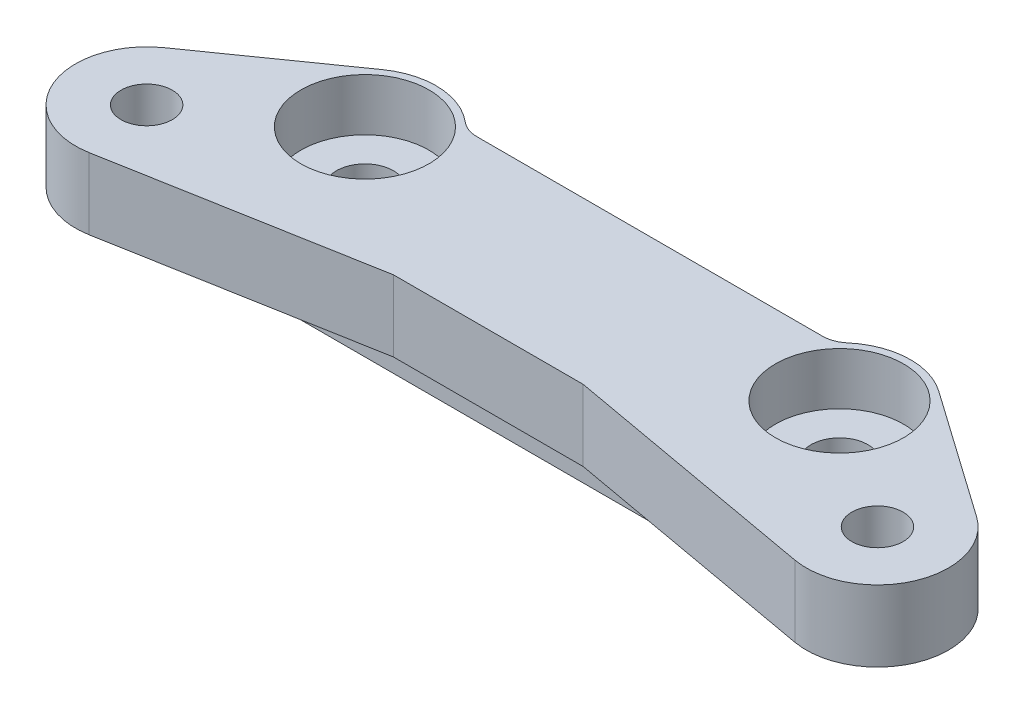
ISO-10303-21;
HEADER;
FILE_DESCRIPTION(('STEP AP214'),'2;1');
FILE_NAME('part.step','',(''),(''),'','','');
FILE_SCHEMA(('AUTOMOTIVE_DESIGN { 1 0 10303 214 1 1 1 1 }'));
ENDSEC;
DATA;
#1=APPLICATION_CONTEXT('core data for automotive mechanical design processes');
#2=APPLICATION_PROTOCOL_DEFINITION('international standard','automotive_design',2000,#1);
#3=PRODUCT_CONTEXT('',#1,'mechanical');
#4=PRODUCT('Part','Part','',(#3));
#5=PRODUCT_RELATED_PRODUCT_CATEGORY('part','',(#4));
#6=PRODUCT_DEFINITION_FORMATION('','',#4);
#7=PRODUCT_DEFINITION_CONTEXT('part definition',#1,'design');
#8=PRODUCT_DEFINITION('design','',#6,#7);
#9=PRODUCT_DEFINITION_SHAPE('','',#8);
#10=(LENGTH_UNIT() NAMED_UNIT(*) SI_UNIT(.MILLI.,.METRE.));
#11=(NAMED_UNIT(*) PLANE_ANGLE_UNIT() SI_UNIT($,.RADIAN.));
#12=(NAMED_UNIT(*) SI_UNIT($,.STERADIAN.) SOLID_ANGLE_UNIT());
#13=UNCERTAINTY_MEASURE_WITH_UNIT(LENGTH_MEASURE(1.E-05),#10,'distance_accuracy_value','');
#14=(GEOMETRIC_REPRESENTATION_CONTEXT(3) GLOBAL_UNCERTAINTY_ASSIGNED_CONTEXT((#13)) GLOBAL_UNIT_ASSIGNED_CONTEXT((#10,
#11,#12)) REPRESENTATION_CONTEXT('',''));
#15=CARTESIAN_POINT('',(0.,0.,0.));
#16=DIRECTION('',(0.,0.,1.));
#17=DIRECTION('',(1.,0.,0.));
#18=AXIS2_PLACEMENT_3D('',#15,#16,#17);
#19=CARTESIAN_POINT('',(0.,27.,-29.));
#20=DIRECTION('',(0.,0.,-1.));
#21=DIRECTION('',(-1.,0.,0.));
#22=AXIS2_PLACEMENT_3D('',#19,#20,#21);
#23=PLANE('',#22);
#24=DIRECTION('',(1.,0.,0.));
#25=VECTOR('',#24,1.);
#26=CARTESIAN_POINT('',(0.,27.,-29.));
#27=LINE('',#26,#25);
#28=CARTESIAN_POINT('',(-36.3985294912646,27.,-29.));
#29=VERTEX_POINT('',#28);
#30=CARTESIAN_POINT('',(36.3985294912645,27.,-29.));
#31=VERTEX_POINT('',#30);
#32=EDGE_CURVE('E203',#29,#31,#27,.T.);
#33=ORIENTED_EDGE('',*,*,#32,.T.);
#34=DIRECTION('',(0.,-1.,0.));
#35=VECTOR('',#34,1.);
#36=CARTESIAN_POINT('',(36.3985294912645,27.,-29.));
#37=LINE('',#36,#35);
#38=CARTESIAN_POINT('',(36.3985294912645,0.,-29.));
#39=VERTEX_POINT('',#38);
#40=EDGE_CURVE('E258',#31,#39,#37,.T.);
#41=ORIENTED_EDGE('',*,*,#40,.T.);
#42=DIRECTION('',(1.,0.,0.));
#43=VECTOR('',#42,1.);
#44=CARTESIAN_POINT('',(0.,0.,-29.));
#45=LINE('',#44,#43);
#46=CARTESIAN_POINT('',(-36.3985294912646,0.,-29.));
#47=VERTEX_POINT('',#46);
#48=EDGE_CURVE('E164',#47,#39,#45,.T.);
#49=ORIENTED_EDGE('',*,*,#48,.F.);
#50=DIRECTION('',(0.,-1.,0.));
#51=VECTOR('',#50,1.);
#52=CARTESIAN_POINT('',(-36.3985294912646,27.,-29.));
#53=LINE('',#52,#51);
#54=EDGE_CURVE('E256',#47,#29,#53,.F.);
#55=ORIENTED_EDGE('',*,*,#54,.T.);
#56=EDGE_LOOP('',(#33,#41,#49,#55));
#57=FACE_BOUND('',#56,.T.);
#58=ADVANCED_FACE('F52',(#57),#23,.T.);
#59=CARTESIAN_POINT('',(-50.,27.,-19.));
#60=DIRECTION('',(0.,-1.,0.));
#61=DIRECTION('',(0.,0.,-1.));
#62=AXIS2_PLACEMENT_3D('',#59,#60,#61);
#63=CYLINDRICAL_SURFACE('',#62,15.);
#64=CARTESIAN_POINT('',(-50.,27.,-19.));
#65=DIRECTION('',(0.,1.,0.));
#66=DIRECTION('',(0.,0.,1.));
#67=AXIS2_PLACEMENT_3D('',#64,#65,#66);
#68=CIRCLE('',#67,15.);
#69=CARTESIAN_POINT('',(-40.2846639223318,27.,-30.4285714285714));
#70=VERTEX_POINT('',#69);
#71=CARTESIAN_POINT('',(-58.6324010926192,27.,-31.2670962895115));
#72=VERTEX_POINT('',#71);
#73=EDGE_CURVE('E206',#70,#72,#68,.T.);
#74=ORIENTED_EDGE('',*,*,#73,.F.);
#75=DIRECTION('',(0.,-1.,0.));
#76=VECTOR('',#75,1.);
#77=CARTESIAN_POINT('',(-40.2846639223318,27.,-30.4285714285714));
#78=LINE('',#77,#76);
#79=CARTESIAN_POINT('',(-40.2846639223318,0.,-30.4285714285714));
#80=VERTEX_POINT('',#79);
#81=EDGE_CURVE('E263',#70,#80,#78,.T.);
#82=ORIENTED_EDGE('',*,*,#81,.T.);
#83=CARTESIAN_POINT('',(-50.,0.,-19.));
#84=DIRECTION('',(0.,1.,0.));
#85=DIRECTION('',(0.,0.,1.));
#86=AXIS2_PLACEMENT_3D('',#83,#84,#85);
#87=CIRCLE('',#86,15.);
#88=CARTESIAN_POINT('',(-50.,0.,-3.99999999999999));
#89=VERTEX_POINT('',#88);
#90=EDGE_CURVE('E231',#80,#89,#87,.T.);
#91=ORIENTED_EDGE('',*,*,#90,.T.);
#92=DIRECTION('',(0.,-1.,0.));
#93=VECTOR('',#92,1.);
#94=CARTESIAN_POINT('',(-50.,12.,-3.99999999999999));
#95=LINE('',#94,#93);
#96=CARTESIAN_POINT('',(-50.,12.,-3.99999999999999));
#97=VERTEX_POINT('',#96);
#98=EDGE_CURVE('E165',#97,#89,#95,.T.);
#99=ORIENTED_EDGE('',*,*,#98,.F.);
#100=CARTESIAN_POINT('',(-50.,12.,-19.));
#101=DIRECTION('',(0.,1.,0.));
#102=DIRECTION('',(0.,0.,1.));
#103=AXIS2_PLACEMENT_3D('',#100,#101,#102);
#104=CIRCLE('',#103,15.);
#105=CARTESIAN_POINT('',(-58.6324010926192,12.,-31.2670962895115));
#106=VERTEX_POINT('',#105);
#107=EDGE_CURVE('E177',#106,#97,#104,.T.);
#108=ORIENTED_EDGE('',*,*,#107,.F.);
#109=DIRECTION('',(0.,-1.,0.));
#110=VECTOR('',#109,1.);
#111=CARTESIAN_POINT('',(-58.6324010926192,27.,-31.2670962895115));
#112=LINE('',#111,#110);
#113=EDGE_CURVE('E253',#72,#106,#112,.T.);
#114=ORIENTED_EDGE('',*,*,#113,.F.);
#115=EDGE_LOOP('',(#74,#82,#91,#99,#108,#114));
#116=FACE_BOUND('',#115,.T.);
#117=ADVANCED_FACE('F275',(#116),#63,.T.);
#118=CARTESIAN_POINT('',(-34.1342359550045,27.,-48.5065458307959));
#119=DIRECTION('',(-0.575493406174613,0.,-0.817806419300767));
#120=DIRECTION('',(-0.817806419300767,0.,0.575493406174613));
#121=AXIS2_PLACEMENT_3D('',#118,#119,#120);
#122=PLANE('',#121);
#123=DIRECTION('',(0.817806419300767,0.,-0.575493406174613));
#124=VECTOR('',#123,1.);
#125=CARTESIAN_POINT('',(-34.1342359550045,12.,-48.5065458307959));
#126=LINE('',#125,#124);
#127=CARTESIAN_POINT('',(-85.6324010926192,12.,-12.2670962895115));
#128=VERTEX_POINT('',#127);
#129=EDGE_CURVE('E179',#128,#106,#126,.T.);
#130=ORIENTED_EDGE('',*,*,#129,.F.);
#131=DIRECTION('',(0.,-1.,0.));
#132=VECTOR('',#131,1.);
#133=CARTESIAN_POINT('',(-85.6324010926192,27.,-12.2670962895115));
#134=LINE('',#133,#132);
#135=CARTESIAN_POINT('',(-85.6324010926192,27.,-12.2670962895115));
#136=VERTEX_POINT('',#135);
#137=EDGE_CURVE('E250',#136,#128,#134,.T.);
#138=ORIENTED_EDGE('',*,*,#137,.F.);
#139=DIRECTION('',(0.817806419300767,0.,-0.575493406174613));
#140=VECTOR('',#139,1.);
#141=CARTESIAN_POINT('',(-34.1342359550045,27.,-48.5065458307959));
#142=LINE('',#141,#140);
#143=EDGE_CURVE('E209',#136,#72,#142,.T.);
#144=ORIENTED_EDGE('',*,*,#143,.T.);
#145=ORIENTED_EDGE('',*,*,#113,.T.);
#146=EDGE_LOOP('',(#130,#138,#144,#145));
#147=FACE_BOUND('',#146,.T.);
#148=ADVANCED_FACE('F284',(#147),#122,.T.);
#149=CARTESIAN_POINT('',(-77.,27.,0.));
#150=DIRECTION('',(0.,-1.,0.));
#151=DIRECTION('',(0.,0.,-1.));
#152=AXIS2_PLACEMENT_3D('',#149,#150,#151);
#153=CYLINDRICAL_SURFACE('',#152,15.);
#154=ORIENTED_EDGE('',*,*,#137,.T.);
#155=CARTESIAN_POINT('',(-77.,12.,0.));
#156=DIRECTION('',(0.,1.,0.));
#157=DIRECTION('',(0.,0.,1.));
#158=AXIS2_PLACEMENT_3D('',#155,#156,#157);
#159=CIRCLE('',#158,15.);
#160=CARTESIAN_POINT('',(-74.347688243031,12.,14.7636459705536));
#161=VERTEX_POINT('',#160);
#162=EDGE_CURVE('E184',#128,#161,#159,.T.);
#163=ORIENTED_EDGE('',*,*,#162,.T.);
#164=DIRECTION('',(0.,-1.,0.));
#165=VECTOR('',#164,1.);
#166=CARTESIAN_POINT('',(-74.347688243031,27.,14.7636459705536));
#167=LINE('',#166,#165);
#168=CARTESIAN_POINT('',(-74.347688243031,27.,14.7636459705536));
#169=VERTEX_POINT('',#168);
#170=EDGE_CURVE('E247',#169,#161,#167,.T.);
#171=ORIENTED_EDGE('',*,*,#170,.F.);
#172=CARTESIAN_POINT('',(-77.,27.,0.));
#173=DIRECTION('',(0.,1.,0.));
#174=DIRECTION('',(0.,0.,1.));
#175=AXIS2_PLACEMENT_3D('',#172,#173,#174);
#176=CIRCLE('',#175,15.);
#177=EDGE_CURVE('E212',#136,#169,#176,.T.);
#178=ORIENTED_EDGE('',*,*,#177,.F.);
#179=EDGE_LOOP('',(#154,#163,#171,#178));
#180=FACE_BOUND('',#179,.T.);
#181=ADVANCED_FACE('F286',(#180),#153,.T.);
#182=CARTESIAN_POINT('',(0.244861359084523,27.,1.36297944911413));
#183=DIRECTION('',(0.176820783797932,0.,0.984243064703574));
#184=DIRECTION('',(0.984243064703575,0.,-0.176820783797932));
#185=AXIS2_PLACEMENT_3D('',#182,#183,#184);
#186=PLANE('',#185);
#187=DIRECTION('',(-0.984243064703575,0.,0.176820783797932));
#188=VECTOR('',#187,1.);
#189=CARTESIAN_POINT('',(0.244861359084523,12.,1.36297944911413));
#190=LINE('',#189,#188);
#191=CARTESIAN_POINT('',(-20.,12.,5.));
#192=VERTEX_POINT('',#191);
#193=EDGE_CURVE('E187',#192,#161,#190,.T.);
#194=ORIENTED_EDGE('',*,*,#193,.F.);
#195=DIRECTION('',(0.,-1.,0.));
#196=VECTOR('',#195,1.);
#197=CARTESIAN_POINT('',(-20.,27.,5.));
#198=LINE('',#197,#196);
#199=CARTESIAN_POINT('',(-20.,27.,5.));
#200=VERTEX_POINT('',#199);
#201=EDGE_CURVE('E244',#200,#192,#198,.T.);
#202=ORIENTED_EDGE('',*,*,#201,.F.);
#203=DIRECTION('',(-0.984243064703575,0.,0.176820783797932));
#204=VECTOR('',#203,1.);
#205=CARTESIAN_POINT('',(0.244861359084523,27.,1.36297944911413));
#206=LINE('',#205,#204);
#207=EDGE_CURVE('E214',#200,#169,#206,.T.);
#208=ORIENTED_EDGE('',*,*,#207,.T.);
#209=ORIENTED_EDGE('',*,*,#170,.T.);
#210=EDGE_LOOP('',(#194,#202,#208,#209));
#211=FACE_BOUND('',#210,.T.);
#212=ADVANCED_FACE('F289',(#211),#186,.T.);
#213=CARTESIAN_POINT('',(0.,27.,5.));
#214=DIRECTION('',(0.,0.,-1.));
#215=DIRECTION('',(-1.,0.,0.));
#216=AXIS2_PLACEMENT_3D('',#213,#214,#215);
#217=PLANE('',#216);
#218=ORIENTED_EDGE('',*,*,#201,.T.);
#219=DIRECTION('',(1.,0.,0.));
#220=VECTOR('',#219,1.);
#221=CARTESIAN_POINT('',(0.,12.,5.));
#222=LINE('',#221,#220);
#223=CARTESIAN_POINT('',(20.,12.,5.));
#224=VERTEX_POINT('',#223);
#225=EDGE_CURVE('E189',#192,#224,#222,.T.);
#226=ORIENTED_EDGE('',*,*,#225,.T.);
#227=DIRECTION('',(0.,-1.,0.));
#228=VECTOR('',#227,1.);
#229=CARTESIAN_POINT('',(20.,27.,5.));
#230=LINE('',#229,#228);
#231=CARTESIAN_POINT('',(20.,27.,5.));
#232=VERTEX_POINT('',#231);
#233=EDGE_CURVE('E241',#232,#224,#230,.T.);
#234=ORIENTED_EDGE('',*,*,#233,.F.);
#235=DIRECTION('',(1.,0.,0.));
#236=VECTOR('',#235,1.);
#237=CARTESIAN_POINT('',(0.,27.,5.));
#238=LINE('',#237,#236);
#239=EDGE_CURVE('E217',#200,#232,#238,.T.);
#240=ORIENTED_EDGE('',*,*,#239,.F.);
#241=EDGE_LOOP('',(#218,#226,#234,#240));
#242=FACE_BOUND('',#241,.T.);
#243=ADVANCED_FACE('F295',(#242),#217,.F.);
#244=CARTESIAN_POINT('',(-0.244861359084523,27.,1.36297944911413));
#245=DIRECTION('',(0.176820783797932,0.,-0.984243064703574));
#246=DIRECTION('',(-0.984243064703575,0.,-0.176820783797932));
#247=AXIS2_PLACEMENT_3D('',#244,#245,#246);
#248=PLANE('',#247);
#249=ORIENTED_EDGE('',*,*,#233,.T.);
#250=DIRECTION('',(0.984243064703575,0.,0.176820783797932));
#251=VECTOR('',#250,1.);
#252=CARTESIAN_POINT('',(-0.244861359084523,12.,1.36297944911413));
#253=LINE('',#252,#251);
#254=CARTESIAN_POINT('',(74.347688243031,12.,14.7636459705536));
#255=VERTEX_POINT('',#254);
#256=EDGE_CURVE('E192',#224,#255,#253,.T.);
#257=ORIENTED_EDGE('',*,*,#256,.T.);
#258=DIRECTION('',(0.,-1.,0.));
#259=VECTOR('',#258,1.);
#260=CARTESIAN_POINT('',(74.347688243031,27.,14.7636459705536));
#261=LINE('',#260,#259);
#262=CARTESIAN_POINT('',(74.347688243031,27.,14.7636459705536));
#263=VERTEX_POINT('',#262);
#264=EDGE_CURVE('E238',#263,#255,#261,.T.);
#265=ORIENTED_EDGE('',*,*,#264,.F.);
#266=DIRECTION('',(0.984243064703575,0.,0.176820783797932));
#267=VECTOR('',#266,1.);
#268=CARTESIAN_POINT('',(-0.244861359084523,27.,1.36297944911413));
#269=LINE('',#268,#267);
#270=EDGE_CURVE('E219',#232,#263,#269,.T.);
#271=ORIENTED_EDGE('',*,*,#270,.F.);
#272=EDGE_LOOP('',(#249,#257,#265,#271));
#273=FACE_BOUND('',#272,.T.);
#274=ADVANCED_FACE('F297',(#273),#248,.F.);
#275=CARTESIAN_POINT('',(77.,27.,0.));
#276=DIRECTION('',(0.,-1.,0.));
#277=DIRECTION('',(0.,0.,-1.));
#278=AXIS2_PLACEMENT_3D('',#275,#276,#277);
#279=CYLINDRICAL_SURFACE('',#278,15.);
#280=ORIENTED_EDGE('',*,*,#264,.T.);
#281=CARTESIAN_POINT('',(77.,12.,0.));
#282=DIRECTION('',(0.,1.,0.));
#283=DIRECTION('',(0.,0.,1.));
#284=AXIS2_PLACEMENT_3D('',#281,#282,#283);
#285=CIRCLE('',#284,15.);
#286=CARTESIAN_POINT('',(85.6324010926192,12.,-12.2670962895115));
#287=VERTEX_POINT('',#286);
#288=EDGE_CURVE('E195',#255,#287,#285,.T.);
#289=ORIENTED_EDGE('',*,*,#288,.T.);
#290=DIRECTION('',(0.,-1.,0.));
#291=VECTOR('',#290,1.);
#292=CARTESIAN_POINT('',(85.6324010926192,27.,-12.2670962895115));
#293=LINE('',#292,#291);
#294=CARTESIAN_POINT('',(85.6324010926192,27.,-12.2670962895115));
#295=VERTEX_POINT('',#294);
#296=EDGE_CURVE('E235',#295,#287,#293,.T.);
#297=ORIENTED_EDGE('',*,*,#296,.F.);
#298=CARTESIAN_POINT('',(77.,27.,0.));
#299=DIRECTION('',(0.,1.,0.));
#300=DIRECTION('',(0.,0.,1.));
#301=AXIS2_PLACEMENT_3D('',#298,#299,#300);
#302=CIRCLE('',#301,15.);
#303=EDGE_CURVE('E221',#263,#295,#302,.T.);
#304=ORIENTED_EDGE('',*,*,#303,.F.);
#305=EDGE_LOOP('',(#280,#289,#297,#304));
#306=FACE_BOUND('',#305,.T.);
#307=ADVANCED_FACE('F301',(#306),#279,.T.);
#308=CARTESIAN_POINT('',(34.1342359550046,27.,-48.5065458307959));
#309=DIRECTION('',(0.575493406174614,0.,-0.817806419300766));
#310=DIRECTION('',(-0.817806419300766,0.,-0.575493406174614));
#311=AXIS2_PLACEMENT_3D('',#308,#309,#310);
#312=PLANE('',#311);
#313=DIRECTION('',(0.817806419300766,0.,0.575493406174614));
#314=VECTOR('',#313,1.);
#315=CARTESIAN_POINT('',(34.1342359550046,12.,-48.5065458307959));
#316=LINE('',#315,#314);
#317=CARTESIAN_POINT('',(58.6324010926192,12.,-31.2670962895115));
#318=VERTEX_POINT('',#317);
#319=EDGE_CURVE('E198',#318,#287,#316,.T.);
#320=ORIENTED_EDGE('',*,*,#319,.F.);
#321=DIRECTION('',(0.,-1.,0.));
#322=VECTOR('',#321,1.);
#323=CARTESIAN_POINT('',(58.6324010926192,27.,-31.2670962895115));
#324=LINE('',#323,#322);
#325=CARTESIAN_POINT('',(58.6324010926192,27.,-31.2670962895115));
#326=VERTEX_POINT('',#325);
#327=EDGE_CURVE('E171',#326,#318,#324,.T.);
#328=ORIENTED_EDGE('',*,*,#327,.F.);
#329=DIRECTION('',(0.817806419300766,0.,0.575493406174614));
#330=VECTOR('',#329,1.);
#331=CARTESIAN_POINT('',(34.1342359550046,27.,-48.5065458307959));
#332=LINE('',#331,#330);
#333=EDGE_CURVE('E223',#326,#295,#332,.T.);
#334=ORIENTED_EDGE('',*,*,#333,.T.);
#335=ORIENTED_EDGE('',*,*,#296,.T.);
#336=EDGE_LOOP('',(#320,#328,#334,#335));
#337=FACE_BOUND('',#336,.T.);
#338=ADVANCED_FACE('F305',(#337),#312,.T.);
#339=CARTESIAN_POINT('',(50.,27.,-19.));
#340=DIRECTION('',(0.,-1.,0.));
#341=DIRECTION('',(0.,0.,-1.));
#342=AXIS2_PLACEMENT_3D('',#339,#340,#341);
#343=CYLINDRICAL_SURFACE('',#342,15.);
#344=CARTESIAN_POINT('',(50.,0.,-19.));
#345=DIRECTION('',(0.,1.,0.));
#346=DIRECTION('',(0.,0.,1.));
#347=AXIS2_PLACEMENT_3D('',#344,#345,#346);
#348=CIRCLE('',#347,15.);
#349=CARTESIAN_POINT('',(50.,0.,-4.));
#350=VERTEX_POINT('',#349);
#351=CARTESIAN_POINT('',(40.2846639223318,0.,-30.4285714285714));
#352=VERTEX_POINT('',#351);
#353=EDGE_CURVE('E207',#350,#352,#348,.T.);
#354=ORIENTED_EDGE('',*,*,#353,.T.);
#355=DIRECTION('',(0.,-1.,0.));
#356=VECTOR('',#355,1.);
#357=CARTESIAN_POINT('',(40.2846639223318,27.,-30.4285714285714));
#358=LINE('',#357,#356);
#359=CARTESIAN_POINT('',(40.2846639223318,27.,-30.4285714285714));
#360=VERTEX_POINT('',#359);
#361=EDGE_CURVE('E261',#352,#360,#358,.F.);
#362=ORIENTED_EDGE('',*,*,#361,.T.);
#363=CARTESIAN_POINT('',(50.,27.,-19.));
#364=DIRECTION('',(0.,1.,0.));
#365=DIRECTION('',(0.,0.,1.));
#366=AXIS2_PLACEMENT_3D('',#363,#364,#365);
#367=CIRCLE('',#366,15.);
#368=EDGE_CURVE('E226',#326,#360,#367,.T.);
#369=ORIENTED_EDGE('',*,*,#368,.F.);
#370=ORIENTED_EDGE('',*,*,#327,.T.);
#371=CARTESIAN_POINT('',(50.,12.,-19.));
#372=DIRECTION('',(0.,1.,0.));
#373=DIRECTION('',(0.,0.,1.));
#374=AXIS2_PLACEMENT_3D('',#371,#372,#373);
#375=CIRCLE('',#374,15.);
#376=CARTESIAN_POINT('',(50.,12.,-4.));
#377=VERTEX_POINT('',#376);
#378=EDGE_CURVE('E168',#377,#318,#375,.T.);
#379=ORIENTED_EDGE('',*,*,#378,.F.);
#380=DIRECTION('',(0.,-1.,0.));
#381=VECTOR('',#380,1.);
#382=CARTESIAN_POINT('',(50.,12.,-4.));
#383=LINE('',#382,#381);
#384=EDGE_CURVE('E153',#377,#350,#383,.T.);
#385=ORIENTED_EDGE('',*,*,#384,.T.);
#386=EDGE_LOOP('',(#354,#362,#369,#370,#379,#385));
#387=FACE_BOUND('',#386,.T.);
#388=ADVANCED_FACE('F169',(#387),#343,.T.);
#389=CARTESIAN_POINT('',(0.,27.,0.));
#390=DIRECTION('',(0.,1.,0.));
#391=DIRECTION('',(0.,0.,1.));
#392=AXIS2_PLACEMENT_3D('',#389,#390,#391);
#393=PLANE('',#392);
#394=CARTESIAN_POINT('',(-50.,27.,-19.));
#395=DIRECTION('',(0.,1.,0.));
#396=DIRECTION('',(0.,0.,1.));
#397=AXIS2_PLACEMENT_3D('',#394,#395,#396);
#398=CIRCLE('',#397,13.5);
#399=CARTESIAN_POINT('',(-50.,27.,-5.49999999999999));
#400=VERTEX_POINT('',#399);
#401=EDGE_CURVE('E387',#400,#400,#398,.T.);
#402=ORIENTED_EDGE('',*,*,#401,.F.);
#403=EDGE_LOOP('',(#402));
#404=FACE_BOUND('',#403,.T.);
#405=CARTESIAN_POINT('',(50.,27.,-19.));
#406=DIRECTION('',(0.,1.,0.));
#407=DIRECTION('',(0.,0.,1.));
#408=AXIS2_PLACEMENT_3D('',#405,#406,#407);
#409=CIRCLE('',#408,13.5);
#410=CARTESIAN_POINT('',(50.,27.,-5.5));
#411=VERTEX_POINT('',#410);
#412=EDGE_CURVE('E396',#411,#411,#409,.T.);
#413=ORIENTED_EDGE('',*,*,#412,.F.);
#414=EDGE_LOOP('',(#413));
#415=FACE_BOUND('',#414,.T.);
#416=CARTESIAN_POINT('',(77.,27.,0.));
#417=DIRECTION('',(0.,-1.,0.));
#418=DIRECTION('',(0.,0.,-1.));
#419=AXIS2_PLACEMENT_3D('',#416,#417,#418);
#420=CIRCLE('',#419,5.4);
#421=CARTESIAN_POINT('',(77.,27.,-5.4));
#422=VERTEX_POINT('',#421);
#423=EDGE_CURVE('E411',#422,#422,#420,.T.);
#424=ORIENTED_EDGE('',*,*,#423,.T.);
#425=EDGE_LOOP('',(#424));
#426=FACE_BOUND('',#425,.T.);
#427=CARTESIAN_POINT('',(-77.,27.,0.));
#428=DIRECTION('',(0.,-1.,0.));
#429=DIRECTION('',(0.,0.,-1.));
#430=AXIS2_PLACEMENT_3D('',#427,#428,#429);
#431=CIRCLE('',#430,5.4);
#432=CARTESIAN_POINT('',(-77.,27.,-5.4));
#433=VERTEX_POINT('',#432);
#434=EDGE_CURVE('E201',#433,#433,#431,.T.);
#435=ORIENTED_EDGE('',*,*,#434,.T.);
#436=EDGE_LOOP('',(#435));
#437=FACE_BOUND('',#436,.T.);
#438=ORIENTED_EDGE('',*,*,#32,.F.);
#439=CARTESIAN_POINT('',(-36.3985294912646,27.,-35.));
#440=DIRECTION('',(0.,1.,0.));
#441=DIRECTION('',(0.,0.,1.));
#442=AXIS2_PLACEMENT_3D('',#439,#440,#441);
#443=CIRCLE('',#442,6.);
#444=EDGE_CURVE('E13',#29,#70,#443,.F.);
#445=ORIENTED_EDGE('',*,*,#444,.T.);
#446=ORIENTED_EDGE('',*,*,#73,.T.);
#447=ORIENTED_EDGE('',*,*,#143,.F.);
#448=ORIENTED_EDGE('',*,*,#177,.T.);
#449=ORIENTED_EDGE('',*,*,#207,.F.);
#450=ORIENTED_EDGE('',*,*,#239,.T.);
#451=ORIENTED_EDGE('',*,*,#270,.T.);
#452=ORIENTED_EDGE('',*,*,#303,.T.);
#453=ORIENTED_EDGE('',*,*,#333,.F.);
#454=ORIENTED_EDGE('',*,*,#368,.T.);
#455=CARTESIAN_POINT('',(36.3985294912645,27.,-35.));
#456=DIRECTION('',(0.,1.,0.));
#457=DIRECTION('',(0.,0.,1.));
#458=AXIS2_PLACEMENT_3D('',#455,#456,#457);
#459=CIRCLE('',#458,6.);
#460=EDGE_CURVE('E267',#360,#31,#459,.F.);
#461=ORIENTED_EDGE('',*,*,#460,.T.);
#462=EDGE_LOOP('',(#438,#445,#446,#447,#448,#449,#450,#451,#452,#453,#454,#461));
#463=FACE_BOUND('',#462,.T.);
#464=ADVANCED_FACE('F278',(#404,#415,#426,#437,#463),#393,.T.);
#465=CARTESIAN_POINT('',(0.,0.,0.));
#466=DIRECTION('',(0.,1.,0.));
#467=DIRECTION('',(0.,0.,1.));
#468=AXIS2_PLACEMENT_3D('',#465,#466,#467);
#469=PLANE('',#468);
#470=CARTESIAN_POINT('',(-50.,0.,-19.));
#471=DIRECTION('',(0.,1.,0.));
#472=DIRECTION('',(0.,0.,1.));
#473=AXIS2_PLACEMENT_3D('',#470,#471,#472);
#474=CIRCLE('',#473,6.);
#475=CARTESIAN_POINT('',(-50.,0.,-13.));
#476=VERTEX_POINT('',#475);
#477=EDGE_CURVE('E389',#476,#476,#474,.T.);
#478=ORIENTED_EDGE('',*,*,#477,.T.);
#479=EDGE_LOOP('',(#478));
#480=FACE_BOUND('',#479,.T.);
#481=CARTESIAN_POINT('',(50.,0.,-19.));
#482=DIRECTION('',(0.,1.,0.));
#483=DIRECTION('',(0.,0.,1.));
#484=AXIS2_PLACEMENT_3D('',#481,#482,#483);
#485=CIRCLE('',#484,6.);
#486=CARTESIAN_POINT('',(50.,0.,-13.));
#487=VERTEX_POINT('',#486);
#488=EDGE_CURVE('E405',#487,#487,#485,.T.);
#489=ORIENTED_EDGE('',*,*,#488,.T.);
#490=EDGE_LOOP('',(#489));
#491=FACE_BOUND('',#490,.T.);
#492=ORIENTED_EDGE('',*,*,#353,.F.);
#493=DIRECTION('',(1.,0.,0.));
#494=VECTOR('',#493,1.);
#495=CARTESIAN_POINT('',(0.,0.,-4.));
#496=LINE('',#495,#494);
#497=EDGE_CURVE('E161',#89,#350,#496,.T.);
#498=ORIENTED_EDGE('',*,*,#497,.F.);
#499=ORIENTED_EDGE('',*,*,#90,.F.);
#500=CARTESIAN_POINT('',(-36.3985294912646,0.,-35.));
#501=DIRECTION('',(0.,1.,0.));
#502=DIRECTION('',(0.,0.,1.));
#503=AXIS2_PLACEMENT_3D('',#500,#501,#502);
#504=CIRCLE('',#503,6.);
#505=EDGE_CURVE('E60',#80,#47,#504,.T.);
#506=ORIENTED_EDGE('',*,*,#505,.T.);
#507=ORIENTED_EDGE('',*,*,#48,.T.);
#508=CARTESIAN_POINT('',(36.3985294912645,0.,-35.));
#509=DIRECTION('',(0.,1.,0.));
#510=DIRECTION('',(0.,0.,1.));
#511=AXIS2_PLACEMENT_3D('',#508,#509,#510);
#512=CIRCLE('',#511,6.);
#513=EDGE_CURVE('E265',#39,#352,#512,.T.);
#514=ORIENTED_EDGE('',*,*,#513,.T.);
#515=EDGE_LOOP('',(#492,#498,#499,#506,#507,#514));
#516=FACE_BOUND('',#515,.T.);
#517=ADVANCED_FACE('F271',(#480,#491,#516),#469,.F.);
#518=CARTESIAN_POINT('',(0.,12.,-4.));
#519=DIRECTION('',(0.,0.,-1.));
#520=DIRECTION('',(-1.,0.,0.));
#521=AXIS2_PLACEMENT_3D('',#518,#519,#520);
#522=PLANE('',#521);
#523=ORIENTED_EDGE('',*,*,#497,.T.);
#524=ORIENTED_EDGE('',*,*,#384,.F.);
#525=DIRECTION('',(1.,0.,0.));
#526=VECTOR('',#525,1.);
#527=CARTESIAN_POINT('',(0.,12.,-4.));
#528=LINE('',#527,#526);
#529=EDGE_CURVE('E158',#97,#377,#528,.T.);
#530=ORIENTED_EDGE('',*,*,#529,.F.);
#531=ORIENTED_EDGE('',*,*,#98,.T.);
#532=EDGE_LOOP('',(#523,#524,#530,#531));
#533=FACE_BOUND('',#532,.T.);
#534=ADVANCED_FACE('F155',(#533),#522,.F.);
#535=CARTESIAN_POINT('',(0.,12.,0.));
#536=DIRECTION('',(0.,1.,0.));
#537=DIRECTION('',(0.,0.,1.));
#538=AXIS2_PLACEMENT_3D('',#535,#536,#537);
#539=PLANE('',#538);
#540=CARTESIAN_POINT('',(77.,12.,0.));
#541=DIRECTION('',(0.,-1.,0.));
#542=DIRECTION('',(0.,0.,-1.));
#543=AXIS2_PLACEMENT_3D('',#540,#541,#542);
#544=CIRCLE('',#543,5.4);
#545=CARTESIAN_POINT('',(77.,12.,-5.4));
#546=VERTEX_POINT('',#545);
#547=EDGE_CURVE('E408',#546,#546,#544,.T.);
#548=ORIENTED_EDGE('',*,*,#547,.F.);
#549=EDGE_LOOP('',(#548));
#550=FACE_BOUND('',#549,.T.);
#551=CARTESIAN_POINT('',(-77.,12.,0.));
#552=DIRECTION('',(0.,-1.,0.));
#553=DIRECTION('',(0.,0.,-1.));
#554=AXIS2_PLACEMENT_3D('',#551,#552,#553);
#555=CIRCLE('',#554,5.4);
#556=CARTESIAN_POINT('',(-77.,12.,-5.4));
#557=VERTEX_POINT('',#556);
#558=EDGE_CURVE('E414',#557,#557,#555,.T.);
#559=ORIENTED_EDGE('',*,*,#558,.F.);
#560=EDGE_LOOP('',(#559));
#561=FACE_BOUND('',#560,.T.);
#562=ORIENTED_EDGE('',*,*,#378,.T.);
#563=ORIENTED_EDGE('',*,*,#319,.T.);
#564=ORIENTED_EDGE('',*,*,#288,.F.);
#565=ORIENTED_EDGE('',*,*,#256,.F.);
#566=ORIENTED_EDGE('',*,*,#225,.F.);
#567=ORIENTED_EDGE('',*,*,#193,.T.);
#568=ORIENTED_EDGE('',*,*,#162,.F.);
#569=ORIENTED_EDGE('',*,*,#129,.T.);
#570=ORIENTED_EDGE('',*,*,#107,.T.);
#571=ORIENTED_EDGE('',*,*,#529,.T.);
#572=EDGE_LOOP('',(#562,#563,#564,#565,#566,#567,#568,#569,#570,#571));
#573=FACE_BOUND('',#572,.T.);
#574=ADVANCED_FACE('F175',(#550,#561,#573),#539,.F.);
#575=CARTESIAN_POINT('',(-77.,12.,0.));
#576=DIRECTION('',(0.,-1.,0.));
#577=DIRECTION('',(0.,0.,-1.));
#578=AXIS2_PLACEMENT_3D('',#575,#576,#577);
#579=CYLINDRICAL_SURFACE('',#578,5.4);
#580=ORIENTED_EDGE('',*,*,#434,.F.);
#581=EDGE_LOOP('',(#580));
#582=FACE_BOUND('',#581,.T.);
#583=ORIENTED_EDGE('',*,*,#558,.T.);
#584=EDGE_LOOP('',(#583));
#585=FACE_BOUND('',#584,.T.);
#586=ADVANCED_FACE('F351',(#582,#585),#579,.F.);
#587=CARTESIAN_POINT('',(77.,12.,0.));
#588=DIRECTION('',(0.,-1.,0.));
#589=DIRECTION('',(0.,0.,-1.));
#590=AXIS2_PLACEMENT_3D('',#587,#588,#589);
#591=CYLINDRICAL_SURFACE('',#590,5.4);
#592=ORIENTED_EDGE('',*,*,#423,.F.);
#593=EDGE_LOOP('',(#592));
#594=FACE_BOUND('',#593,.T.);
#595=ORIENTED_EDGE('',*,*,#547,.T.);
#596=EDGE_LOOP('',(#595));
#597=FACE_BOUND('',#596,.T.);
#598=ADVANCED_FACE('F355',(#594,#597),#591,.F.);
#599=CARTESIAN_POINT('',(50.,27.,-19.));
#600=DIRECTION('',(0.,1.,0.));
#601=DIRECTION('',(0.,0.,1.));
#602=AXIS2_PLACEMENT_3D('',#599,#600,#601);
#603=CYLINDRICAL_SURFACE('',#602,6.);
#604=ORIENTED_EDGE('',*,*,#488,.F.);
#605=EDGE_LOOP('',(#604));
#606=FACE_BOUND('',#605,.T.);
#607=CARTESIAN_POINT('',(50.,16.,-19.));
#608=DIRECTION('',(0.,1.,0.));
#609=DIRECTION('',(0.,0.,1.));
#610=AXIS2_PLACEMENT_3D('',#607,#608,#609);
#611=CIRCLE('',#610,6.);
#612=CARTESIAN_POINT('',(50.,16.,-13.));
#613=VERTEX_POINT('',#612);
#614=EDGE_CURVE('E402',#613,#613,#611,.T.);
#615=ORIENTED_EDGE('',*,*,#614,.T.);
#616=EDGE_LOOP('',(#615));
#617=FACE_BOUND('',#616,.T.);
#618=ADVANCED_FACE('F359',(#606,#617),#603,.F.);
#619=CARTESIAN_POINT('',(56.,16.,-19.));
#620=DIRECTION('',(0.,-1.,0.));
#621=DIRECTION('',(0.,0.,-1.));
#622=AXIS2_PLACEMENT_3D('',#619,#620,#621);
#623=PLANE('',#622);
#624=ORIENTED_EDGE('',*,*,#614,.F.);
#625=EDGE_LOOP('',(#624));
#626=FACE_BOUND('',#625,.T.);
#627=CARTESIAN_POINT('',(50.,16.,-19.));
#628=DIRECTION('',(0.,1.,0.));
#629=DIRECTION('',(0.,0.,1.));
#630=AXIS2_PLACEMENT_3D('',#627,#628,#629);
#631=CIRCLE('',#630,13.5);
#632=CARTESIAN_POINT('',(50.,16.,-5.5));
#633=VERTEX_POINT('',#632);
#634=EDGE_CURVE('E399',#633,#633,#631,.T.);
#635=ORIENTED_EDGE('',*,*,#634,.T.);
#636=EDGE_LOOP('',(#635));
#637=FACE_BOUND('',#636,.T.);
#638=ADVANCED_FACE('F363',(#626,#637),#623,.F.);
#639=CARTESIAN_POINT('',(50.,27.,-19.));
#640=DIRECTION('',(0.,1.,0.));
#641=DIRECTION('',(0.,0.,1.));
#642=AXIS2_PLACEMENT_3D('',#639,#640,#641);
#643=CYLINDRICAL_SURFACE('',#642,13.5);
#644=ORIENTED_EDGE('',*,*,#634,.F.);
#645=EDGE_LOOP('',(#644));
#646=FACE_BOUND('',#645,.T.);
#647=ORIENTED_EDGE('',*,*,#412,.T.);
#648=EDGE_LOOP('',(#647));
#649=FACE_BOUND('',#648,.T.);
#650=ADVANCED_FACE('F367',(#646,#649),#643,.F.);
#651=CARTESIAN_POINT('',(-50.,27.,-19.));
#652=DIRECTION('',(0.,1.,0.));
#653=DIRECTION('',(0.,0.,1.));
#654=AXIS2_PLACEMENT_3D('',#651,#652,#653);
#655=CYLINDRICAL_SURFACE('',#654,6.);
#656=ORIENTED_EDGE('',*,*,#477,.F.);
#657=EDGE_LOOP('',(#656));
#658=FACE_BOUND('',#657,.T.);
#659=CARTESIAN_POINT('',(-50.,16.,-19.));
#660=DIRECTION('',(0.,1.,0.));
#661=DIRECTION('',(0.,0.,1.));
#662=AXIS2_PLACEMENT_3D('',#659,#660,#661);
#663=CIRCLE('',#662,6.);
#664=CARTESIAN_POINT('',(-50.,16.,-13.));
#665=VERTEX_POINT('',#664);
#666=EDGE_CURVE('E383',#665,#665,#663,.T.);
#667=ORIENTED_EDGE('',*,*,#666,.T.);
#668=EDGE_LOOP('',(#667));
#669=FACE_BOUND('',#668,.T.);
#670=ADVANCED_FACE('F371',(#658,#669),#655,.F.);
#671=CARTESIAN_POINT('',(-44.,16.,-19.));
#672=DIRECTION('',(0.,-1.,0.));
#673=DIRECTION('',(0.,0.,-1.));
#674=AXIS2_PLACEMENT_3D('',#671,#672,#673);
#675=PLANE('',#674);
#676=ORIENTED_EDGE('',*,*,#666,.F.);
#677=EDGE_LOOP('',(#676));
#678=FACE_BOUND('',#677,.T.);
#679=CARTESIAN_POINT('',(-50.,16.,-19.));
#680=DIRECTION('',(0.,1.,0.));
#681=DIRECTION('',(0.,0.,1.));
#682=AXIS2_PLACEMENT_3D('',#679,#680,#681);
#683=CIRCLE('',#682,13.5);
#684=CARTESIAN_POINT('',(-50.,16.,-5.49999999999999));
#685=VERTEX_POINT('',#684);
#686=EDGE_CURVE('E386',#685,#685,#683,.T.);
#687=ORIENTED_EDGE('',*,*,#686,.T.);
#688=EDGE_LOOP('',(#687));
#689=FACE_BOUND('',#688,.T.);
#690=ADVANCED_FACE('F315',(#678,#689),#675,.F.);
#691=CARTESIAN_POINT('',(-50.,27.,-19.));
#692=DIRECTION('',(0.,1.,0.));
#693=DIRECTION('',(0.,0.,1.));
#694=AXIS2_PLACEMENT_3D('',#691,#692,#693);
#695=CYLINDRICAL_SURFACE('',#694,13.5);
#696=ORIENTED_EDGE('',*,*,#686,.F.);
#697=EDGE_LOOP('',(#696));
#698=FACE_BOUND('',#697,.T.);
#699=ORIENTED_EDGE('',*,*,#401,.T.);
#700=EDGE_LOOP('',(#699));
#701=FACE_BOUND('',#700,.T.);
#702=ADVANCED_FACE('F310',(#698,#701),#695,.F.);
#703=CARTESIAN_POINT('',(36.3985294912645,27.,-35.));
#704=DIRECTION('',(0.,-1.,0.));
#705=DIRECTION('',(0.,0.,-1.));
#706=AXIS2_PLACEMENT_3D('',#703,#704,#705);
#707=CYLINDRICAL_SURFACE('',#706,6.);
#708=ORIENTED_EDGE('',*,*,#460,.F.);
#709=ORIENTED_EDGE('',*,*,#361,.F.);
#710=ORIENTED_EDGE('',*,*,#513,.F.);
#711=ORIENTED_EDGE('',*,*,#40,.F.);
#712=EDGE_LOOP('',(#708,#709,#710,#711));
#713=FACE_BOUND('',#712,.T.);
#714=ADVANCED_FACE('F308',(#713),#707,.F.);
#715=CARTESIAN_POINT('',(-36.3985294912646,27.,-35.));
#716=DIRECTION('',(0.,-1.,0.));
#717=DIRECTION('',(0.,0.,-1.));
#718=AXIS2_PLACEMENT_3D('',#715,#716,#717);
#719=CYLINDRICAL_SURFACE('',#718,6.);
#720=ORIENTED_EDGE('',*,*,#444,.F.);
#721=ORIENTED_EDGE('',*,*,#54,.F.);
#722=ORIENTED_EDGE('',*,*,#505,.F.);
#723=ORIENTED_EDGE('',*,*,#81,.F.);
#724=EDGE_LOOP('',(#720,#721,#722,#723));
#725=FACE_BOUND('',#724,.T.);
#726=ADVANCED_FACE('F54',(#725),#719,.F.);
#727=CLOSED_SHELL('',(#58,#117,#148,#181,#212,#243,#274,#307,#338,#388,#464,#517,#534,#574,#586,
#598,#618,#638,#650,#670,#690,#702,#714,#726));
#728=MANIFOLD_SOLID_BREP('B2',#727);
#729=ADVANCED_BREP_SHAPE_REPRESENTATION('',(#18,#728),#14);
#730=SHAPE_DEFINITION_REPRESENTATION(#9,#729);
ENDSEC;
END-ISO-10303-21;
